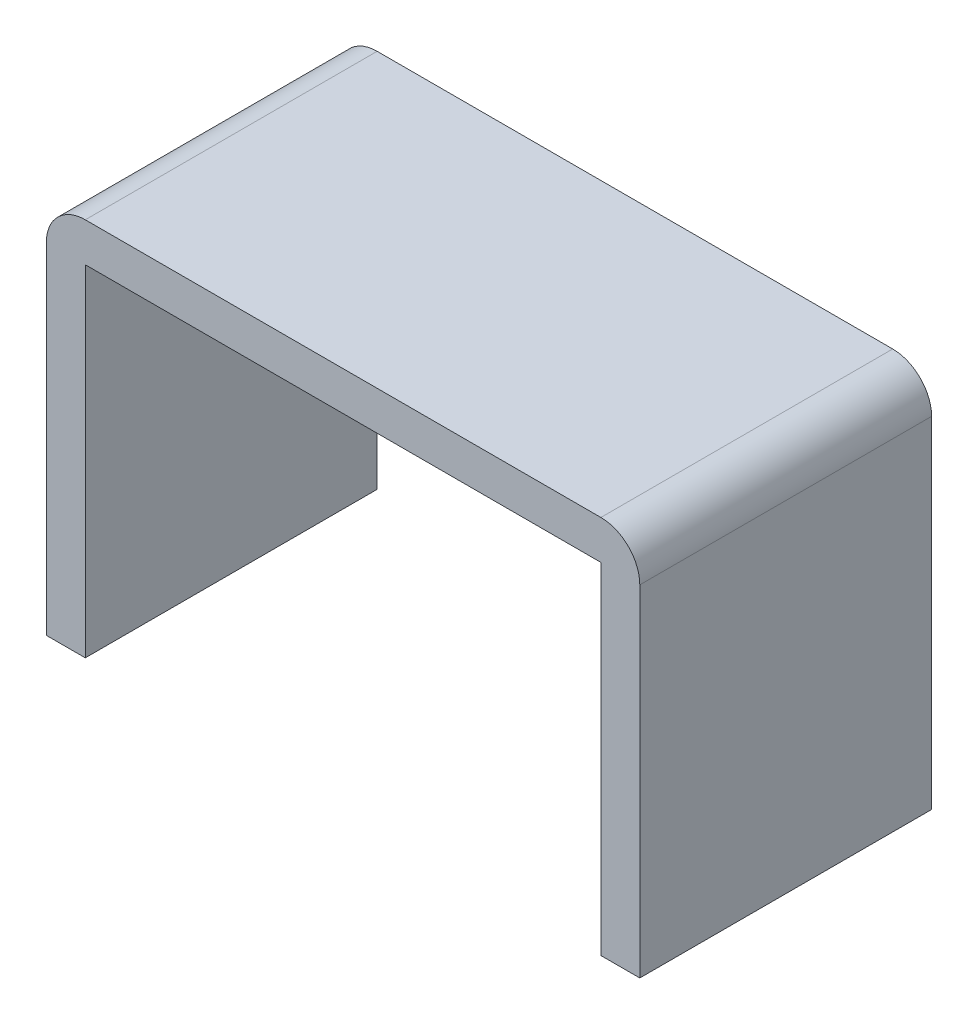
ISO-10303-21;
HEADER;
FILE_DESCRIPTION(('STEP AP214'),'2;1');
FILE_NAME('part.step','',(''),(''),'','','');
FILE_SCHEMA(('AUTOMOTIVE_DESIGN { 1 0 10303 214 1 1 1 1 }'));
ENDSEC;
DATA;
#1=APPLICATION_CONTEXT('core data for automotive mechanical design processes');
#2=APPLICATION_PROTOCOL_DEFINITION('international standard','automotive_design',2000,#1);
#3=PRODUCT_CONTEXT('',#1,'mechanical');
#4=PRODUCT('Part','Part','',(#3));
#5=PRODUCT_RELATED_PRODUCT_CATEGORY('part','',(#4));
#6=PRODUCT_DEFINITION_FORMATION('','',#4);
#7=PRODUCT_DEFINITION_CONTEXT('part definition',#1,'design');
#8=PRODUCT_DEFINITION('design','',#6,#7);
#9=PRODUCT_DEFINITION_SHAPE('','',#8);
#10=(LENGTH_UNIT() NAMED_UNIT(*) SI_UNIT(.MILLI.,.METRE.));
#11=(NAMED_UNIT(*) PLANE_ANGLE_UNIT() SI_UNIT($,.RADIAN.));
#12=(NAMED_UNIT(*) SI_UNIT($,.STERADIAN.) SOLID_ANGLE_UNIT());
#13=UNCERTAINTY_MEASURE_WITH_UNIT(LENGTH_MEASURE(1.E-05),#10,'distance_accuracy_value','');
#14=(GEOMETRIC_REPRESENTATION_CONTEXT(3) GLOBAL_UNCERTAINTY_ASSIGNED_CONTEXT((#13)) GLOBAL_UNIT_ASSIGNED_CONTEXT((#10,
#11,#12)) REPRESENTATION_CONTEXT('',''));
#15=CARTESIAN_POINT('',(0.,0.,0.));
#16=DIRECTION('',(0.,0.,1.));
#17=DIRECTION('',(1.,0.,0.));
#18=AXIS2_PLACEMENT_3D('',#15,#16,#17);
#19=CARTESIAN_POINT('',(4.,0.,30.));
#20=DIRECTION('',(0.,1.,0.));
#21=DIRECTION('',(-1.,0.,0.));
#22=AXIS2_PLACEMENT_3D('',#19,#20,#21);
#23=PLANE('',#22);
#24=DIRECTION('',(1.,0.,0.));
#25=VECTOR('',#24,1.);
#26=CARTESIAN_POINT('',(4.,0.,0.));
#27=LINE('',#26,#25);
#28=CARTESIAN_POINT('',(0.,0.,0.));
#29=VERTEX_POINT('',#28);
#30=CARTESIAN_POINT('',(4.,0.,0.));
#31=VERTEX_POINT('',#30);
#32=EDGE_CURVE('E140',#29,#31,#27,.T.);
#33=ORIENTED_EDGE('',*,*,#32,.T.);
#34=DIRECTION('',(0.,0.,-1.));
#35=VECTOR('',#34,1.);
#36=CARTESIAN_POINT('',(4.,0.,30.));
#37=LINE('',#36,#35);
#38=CARTESIAN_POINT('',(4.,0.,30.));
#39=VERTEX_POINT('',#38);
#40=EDGE_CURVE('E11',#39,#31,#37,.T.);
#41=ORIENTED_EDGE('',*,*,#40,.F.);
#42=DIRECTION('',(1.,0.,0.));
#43=VECTOR('',#42,1.);
#44=CARTESIAN_POINT('',(4.,0.,30.));
#45=LINE('',#44,#43);
#46=CARTESIAN_POINT('',(0.,0.,30.));
#47=VERTEX_POINT('',#46);
#48=EDGE_CURVE('E158',#47,#39,#45,.T.);
#49=ORIENTED_EDGE('',*,*,#48,.F.);
#50=DIRECTION('',(0.,0.,-1.));
#51=VECTOR('',#50,1.);
#52=CARTESIAN_POINT('',(0.,0.,30.));
#53=LINE('',#52,#51);
#54=EDGE_CURVE('E136',#47,#29,#53,.T.);
#55=ORIENTED_EDGE('',*,*,#54,.T.);
#56=EDGE_LOOP('',(#33,#41,#49,#55));
#57=FACE_BOUND('',#56,.T.);
#58=ADVANCED_FACE('F32',(#57),#23,.F.);
#59=CARTESIAN_POINT('',(4.,35.,30.));
#60=DIRECTION('',(-1.,0.,0.));
#61=DIRECTION('',(0.,-1.,0.));
#62=AXIS2_PLACEMENT_3D('',#59,#60,#61);
#63=PLANE('',#62);
#64=DIRECTION('',(0.,1.,0.));
#65=VECTOR('',#64,1.);
#66=CARTESIAN_POINT('',(4.,35.,0.));
#67=LINE('',#66,#65);
#68=CARTESIAN_POINT('',(4.,35.,0.));
#69=VERTEX_POINT('',#68);
#70=EDGE_CURVE('E143',#31,#69,#67,.T.);
#71=ORIENTED_EDGE('',*,*,#70,.T.);
#72=DIRECTION('',(0.,0.,-1.));
#73=VECTOR('',#72,1.);
#74=CARTESIAN_POINT('',(4.,35.,30.));
#75=LINE('',#74,#73);
#76=CARTESIAN_POINT('',(4.,35.,30.));
#77=VERTEX_POINT('',#76);
#78=EDGE_CURVE('E40',#77,#69,#75,.T.);
#79=ORIENTED_EDGE('',*,*,#78,.F.);
#80=DIRECTION('',(0.,1.,0.));
#81=VECTOR('',#80,1.);
#82=CARTESIAN_POINT('',(4.,35.,30.));
#83=LINE('',#82,#81);
#84=EDGE_CURVE('E97',#39,#77,#83,.T.);
#85=ORIENTED_EDGE('',*,*,#84,.F.);
#86=ORIENTED_EDGE('',*,*,#40,.T.);
#87=EDGE_LOOP('',(#71,#79,#85,#86));
#88=FACE_BOUND('',#87,.T.);
#89=ADVANCED_FACE('F207',(#88),#63,.F.);
#90=CARTESIAN_POINT('',(57.,35.,30.));
#91=DIRECTION('',(0.,1.,0.));
#92=DIRECTION('',(-1.,0.,0.));
#93=AXIS2_PLACEMENT_3D('',#90,#91,#92);
#94=PLANE('',#93);
#95=DIRECTION('',(1.,0.,0.));
#96=VECTOR('',#95,1.);
#97=CARTESIAN_POINT('',(57.,35.,0.));
#98=LINE('',#97,#96);
#99=CARTESIAN_POINT('',(57.,35.,0.));
#100=VERTEX_POINT('',#99);
#101=EDGE_CURVE('E145',#69,#100,#98,.T.);
#102=ORIENTED_EDGE('',*,*,#101,.T.);
#103=DIRECTION('',(0.,0.,-1.));
#104=VECTOR('',#103,1.);
#105=CARTESIAN_POINT('',(57.,35.,30.));
#106=LINE('',#105,#104);
#107=CARTESIAN_POINT('',(57.,35.,30.));
#108=VERTEX_POINT('',#107);
#109=EDGE_CURVE('E171',#108,#100,#106,.T.);
#110=ORIENTED_EDGE('',*,*,#109,.F.);
#111=DIRECTION('',(1.,0.,0.));
#112=VECTOR('',#111,1.);
#113=CARTESIAN_POINT('',(57.,35.,30.));
#114=LINE('',#113,#112);
#115=EDGE_CURVE('E179',#77,#108,#114,.T.);
#116=ORIENTED_EDGE('',*,*,#115,.F.);
#117=ORIENTED_EDGE('',*,*,#78,.T.);
#118=EDGE_LOOP('',(#102,#110,#116,#117));
#119=FACE_BOUND('',#118,.T.);
#120=ADVANCED_FACE('F177',(#119),#94,.F.);
#121=CARTESIAN_POINT('',(57.,0.,30.));
#122=DIRECTION('',(1.,0.,0.));
#123=DIRECTION('',(0.,1.,0.));
#124=AXIS2_PLACEMENT_3D('',#121,#122,#123);
#125=PLANE('',#124);
#126=DIRECTION('',(0.,-1.,0.));
#127=VECTOR('',#126,1.);
#128=CARTESIAN_POINT('',(57.,0.,0.));
#129=LINE('',#128,#127);
#130=CARTESIAN_POINT('',(57.,0.,0.));
#131=VERTEX_POINT('',#130);
#132=EDGE_CURVE('E147',#100,#131,#129,.T.);
#133=ORIENTED_EDGE('',*,*,#132,.T.);
#134=DIRECTION('',(0.,0.,-1.));
#135=VECTOR('',#134,1.);
#136=CARTESIAN_POINT('',(57.,0.,30.));
#137=LINE('',#136,#135);
#138=CARTESIAN_POINT('',(57.,0.,30.));
#139=VERTEX_POINT('',#138);
#140=EDGE_CURVE('E168',#139,#131,#137,.T.);
#141=ORIENTED_EDGE('',*,*,#140,.F.);
#142=DIRECTION('',(0.,-1.,0.));
#143=VECTOR('',#142,1.);
#144=CARTESIAN_POINT('',(57.,0.,30.));
#145=LINE('',#144,#143);
#146=EDGE_CURVE('E197',#108,#139,#145,.T.);
#147=ORIENTED_EDGE('',*,*,#146,.F.);
#148=ORIENTED_EDGE('',*,*,#109,.T.);
#149=EDGE_LOOP('',(#133,#141,#147,#148));
#150=FACE_BOUND('',#149,.T.);
#151=ADVANCED_FACE('F188',(#150),#125,.F.);
#152=CARTESIAN_POINT('',(61.,0.,30.));
#153=DIRECTION('',(0.,1.,0.));
#154=DIRECTION('',(-1.,0.,0.));
#155=AXIS2_PLACEMENT_3D('',#152,#153,#154);
#156=PLANE('',#155);
#157=DIRECTION('',(1.,0.,0.));
#158=VECTOR('',#157,1.);
#159=CARTESIAN_POINT('',(61.,0.,0.));
#160=LINE('',#159,#158);
#161=CARTESIAN_POINT('',(61.,0.,0.));
#162=VERTEX_POINT('',#161);
#163=EDGE_CURVE('E149',#131,#162,#160,.T.);
#164=ORIENTED_EDGE('',*,*,#163,.T.);
#165=DIRECTION('',(0.,0.,-1.));
#166=VECTOR('',#165,1.);
#167=CARTESIAN_POINT('',(61.,0.,30.));
#168=LINE('',#167,#166);
#169=CARTESIAN_POINT('',(61.,0.,30.));
#170=VERTEX_POINT('',#169);
#171=EDGE_CURVE('E165',#170,#162,#168,.T.);
#172=ORIENTED_EDGE('',*,*,#171,.F.);
#173=DIRECTION('',(1.,0.,0.));
#174=VECTOR('',#173,1.);
#175=CARTESIAN_POINT('',(61.,0.,30.));
#176=LINE('',#175,#174);
#177=EDGE_CURVE('E194',#139,#170,#176,.T.);
#178=ORIENTED_EDGE('',*,*,#177,.F.);
#179=ORIENTED_EDGE('',*,*,#140,.T.);
#180=EDGE_LOOP('',(#164,#172,#178,#179));
#181=FACE_BOUND('',#180,.T.);
#182=ADVANCED_FACE('F192',(#181),#156,.F.);
#183=CARTESIAN_POINT('',(61.,35.,30.));
#184=DIRECTION('',(-1.,0.,0.));
#185=DIRECTION('',(0.,-1.,0.));
#186=AXIS2_PLACEMENT_3D('',#183,#184,#185);
#187=PLANE('',#186);
#188=DIRECTION('',(0.,1.,0.));
#189=VECTOR('',#188,1.);
#190=CARTESIAN_POINT('',(61.,35.,0.));
#191=LINE('',#190,#189);
#192=CARTESIAN_POINT('',(61.,35.,0.));
#193=VERTEX_POINT('',#192);
#194=EDGE_CURVE('E151',#162,#193,#191,.T.);
#195=ORIENTED_EDGE('',*,*,#194,.T.);
#196=DIRECTION('',(0.,0.,-1.));
#197=VECTOR('',#196,1.);
#198=CARTESIAN_POINT('',(61.,35.,30.));
#199=LINE('',#198,#197);
#200=CARTESIAN_POINT('',(61.,35.,30.));
#201=VERTEX_POINT('',#200);
#202=EDGE_CURVE('E162',#201,#193,#199,.T.);
#203=ORIENTED_EDGE('',*,*,#202,.F.);
#204=DIRECTION('',(0.,1.,0.));
#205=VECTOR('',#204,1.);
#206=CARTESIAN_POINT('',(61.,35.,30.));
#207=LINE('',#206,#205);
#208=EDGE_CURVE('E196',#170,#201,#207,.T.);
#209=ORIENTED_EDGE('',*,*,#208,.F.);
#210=ORIENTED_EDGE('',*,*,#171,.T.);
#211=EDGE_LOOP('',(#195,#203,#209,#210));
#212=FACE_BOUND('',#211,.T.);
#213=ADVANCED_FACE('F219',(#212),#187,.F.);
#214=CARTESIAN_POINT('',(57.,35.,30.));
#215=DIRECTION('',(0.,0.,-1.));
#216=DIRECTION('',(-1.,0.,0.));
#217=AXIS2_PLACEMENT_3D('',#214,#215,#216);
#218=CYLINDRICAL_SURFACE('',#217,4.);
#219=CARTESIAN_POINT('',(57.,35.,0.));
#220=DIRECTION('',(0.,0.,1.));
#221=DIRECTION('',(-1.,0.,0.));
#222=AXIS2_PLACEMENT_3D('',#219,#220,#221);
#223=CIRCLE('',#222,4.);
#224=CARTESIAN_POINT('',(57.,39.,0.));
#225=VERTEX_POINT('',#224);
#226=EDGE_CURVE('E153',#193,#225,#223,.T.);
#227=ORIENTED_EDGE('',*,*,#226,.T.);
#228=DIRECTION('',(0.,0.,-1.));
#229=VECTOR('',#228,1.);
#230=CARTESIAN_POINT('',(57.,39.,30.));
#231=LINE('',#230,#229);
#232=CARTESIAN_POINT('',(57.,39.,30.));
#233=VERTEX_POINT('',#232);
#234=EDGE_CURVE('E131',#233,#225,#231,.T.);
#235=ORIENTED_EDGE('',*,*,#234,.F.);
#236=CARTESIAN_POINT('',(57.,35.,30.));
#237=DIRECTION('',(0.,0.,1.));
#238=DIRECTION('',(-1.,0.,0.));
#239=AXIS2_PLACEMENT_3D('',#236,#237,#238);
#240=CIRCLE('',#239,4.);
#241=EDGE_CURVE('E122',#201,#233,#240,.T.);
#242=ORIENTED_EDGE('',*,*,#241,.F.);
#243=ORIENTED_EDGE('',*,*,#202,.T.);
#244=EDGE_LOOP('',(#227,#235,#242,#243));
#245=FACE_BOUND('',#244,.T.);
#246=ADVANCED_FACE('F222',(#245),#218,.T.);
#247=CARTESIAN_POINT('',(4.00000000000003,39.,30.));
#248=DIRECTION('',(0.,-1.,0.));
#249=DIRECTION('',(0.,0.,-1.));
#250=AXIS2_PLACEMENT_3D('',#247,#248,#249);
#251=PLANE('',#250);
#252=DIRECTION('',(-1.,0.,0.));
#253=VECTOR('',#252,1.);
#254=CARTESIAN_POINT('',(4.00000000000003,39.,0.));
#255=LINE('',#254,#253);
#256=CARTESIAN_POINT('',(4.00000000000003,39.,0.));
#257=VERTEX_POINT('',#256);
#258=EDGE_CURVE('E130',#225,#257,#255,.T.);
#259=ORIENTED_EDGE('',*,*,#258,.T.);
#260=DIRECTION('',(0.,0.,-1.));
#261=VECTOR('',#260,1.);
#262=CARTESIAN_POINT('',(4.00000000000003,39.,30.));
#263=LINE('',#262,#261);
#264=CARTESIAN_POINT('',(4.00000000000003,39.,30.));
#265=VERTEX_POINT('',#264);
#266=EDGE_CURVE('E127',#265,#257,#263,.T.);
#267=ORIENTED_EDGE('',*,*,#266,.F.);
#268=DIRECTION('',(-1.,0.,0.));
#269=VECTOR('',#268,1.);
#270=CARTESIAN_POINT('',(4.00000000000003,39.,30.));
#271=LINE('',#270,#269);
#272=EDGE_CURVE('E116',#233,#265,#271,.T.);
#273=ORIENTED_EDGE('',*,*,#272,.F.);
#274=ORIENTED_EDGE('',*,*,#234,.T.);
#275=EDGE_LOOP('',(#259,#267,#273,#274));
#276=FACE_BOUND('',#275,.T.);
#277=ADVANCED_FACE('F128',(#276),#251,.F.);
#278=CARTESIAN_POINT('',(4.,35.,30.));
#279=DIRECTION('',(0.,0.,-1.));
#280=DIRECTION('',(-1.,0.,0.));
#281=AXIS2_PLACEMENT_3D('',#278,#279,#280);
#282=CYLINDRICAL_SURFACE('',#281,4.);
#283=CARTESIAN_POINT('',(4.,35.,0.));
#284=DIRECTION('',(0.,0.,1.));
#285=DIRECTION('',(-1.,0.,0.));
#286=AXIS2_PLACEMENT_3D('',#283,#284,#285);
#287=CIRCLE('',#286,4.);
#288=CARTESIAN_POINT('',(0.,35.,0.));
#289=VERTEX_POINT('',#288);
#290=EDGE_CURVE('E83',#257,#289,#287,.T.);
#291=ORIENTED_EDGE('',*,*,#290,.T.);
#292=DIRECTION('',(0.,0.,-1.));
#293=VECTOR('',#292,1.);
#294=CARTESIAN_POINT('',(0.,35.,30.));
#295=LINE('',#294,#293);
#296=CARTESIAN_POINT('',(0.,35.,30.));
#297=VERTEX_POINT('',#296);
#298=EDGE_CURVE('E132',#297,#289,#295,.T.);
#299=ORIENTED_EDGE('',*,*,#298,.F.);
#300=CARTESIAN_POINT('',(4.,35.,30.));
#301=DIRECTION('',(0.,0.,1.));
#302=DIRECTION('',(-1.,0.,0.));
#303=AXIS2_PLACEMENT_3D('',#300,#301,#302);
#304=CIRCLE('',#303,4.);
#305=EDGE_CURVE('E120',#265,#297,#304,.T.);
#306=ORIENTED_EDGE('',*,*,#305,.F.);
#307=ORIENTED_EDGE('',*,*,#266,.T.);
#308=EDGE_LOOP('',(#291,#299,#306,#307));
#309=FACE_BOUND('',#308,.T.);
#310=ADVANCED_FACE('F134',(#309),#282,.T.);
#311=CARTESIAN_POINT('',(0.,0.,30.));
#312=DIRECTION('',(1.,0.,0.));
#313=DIRECTION('',(0.,0.,-1.));
#314=AXIS2_PLACEMENT_3D('',#311,#312,#313);
#315=PLANE('',#314);
#316=DIRECTION('',(0.,-1.,0.));
#317=VECTOR('',#316,1.);
#318=CARTESIAN_POINT('',(0.,0.,0.));
#319=LINE('',#318,#317);
#320=EDGE_CURVE('E89',#289,#29,#319,.T.);
#321=ORIENTED_EDGE('',*,*,#320,.T.);
#322=ORIENTED_EDGE('',*,*,#54,.F.);
#323=DIRECTION('',(0.,-1.,0.));
#324=VECTOR('',#323,1.);
#325=CARTESIAN_POINT('',(0.,0.,30.));
#326=LINE('',#325,#324);
#327=EDGE_CURVE('E48',#297,#47,#326,.T.);
#328=ORIENTED_EDGE('',*,*,#327,.F.);
#329=ORIENTED_EDGE('',*,*,#298,.T.);
#330=EDGE_LOOP('',(#321,#322,#328,#329));
#331=FACE_BOUND('',#330,.T.);
#332=ADVANCED_FACE('F231',(#331),#315,.F.);
#333=CARTESIAN_POINT('',(4.,35.,30.));
#334=DIRECTION('',(0.,0.,-1.));
#335=DIRECTION('',(-1.,0.,0.));
#336=AXIS2_PLACEMENT_3D('',#333,#334,#335);
#337=PLANE('',#336);
#338=ORIENTED_EDGE('',*,*,#48,.T.);
#339=ORIENTED_EDGE('',*,*,#84,.T.);
#340=ORIENTED_EDGE('',*,*,#115,.T.);
#341=ORIENTED_EDGE('',*,*,#146,.T.);
#342=ORIENTED_EDGE('',*,*,#177,.T.);
#343=ORIENTED_EDGE('',*,*,#208,.T.);
#344=ORIENTED_EDGE('',*,*,#241,.T.);
#345=ORIENTED_EDGE('',*,*,#272,.T.);
#346=ORIENTED_EDGE('',*,*,#305,.T.);
#347=ORIENTED_EDGE('',*,*,#327,.T.);
#348=EDGE_LOOP('',(#338,#339,#340,#341,#342,#343,#344,#345,#346,#347));
#349=FACE_BOUND('',#348,.T.);
#350=ADVANCED_FACE('F118',(#349),#337,.F.);
#351=CARTESIAN_POINT('',(4.,35.,0.));
#352=DIRECTION('',(0.,0.,-1.));
#353=DIRECTION('',(-1.,0.,0.));
#354=AXIS2_PLACEMENT_3D('',#351,#352,#353);
#355=PLANE('',#354);
#356=ORIENTED_EDGE('',*,*,#32,.F.);
#357=ORIENTED_EDGE('',*,*,#320,.F.);
#358=ORIENTED_EDGE('',*,*,#290,.F.);
#359=ORIENTED_EDGE('',*,*,#258,.F.);
#360=ORIENTED_EDGE('',*,*,#226,.F.);
#361=ORIENTED_EDGE('',*,*,#194,.F.);
#362=ORIENTED_EDGE('',*,*,#163,.F.);
#363=ORIENTED_EDGE('',*,*,#132,.F.);
#364=ORIENTED_EDGE('',*,*,#101,.F.);
#365=ORIENTED_EDGE('',*,*,#70,.F.);
#366=EDGE_LOOP('',(#356,#357,#358,#359,#360,#361,#362,#363,#364,#365));
#367=FACE_BOUND('',#366,.T.);
#368=ADVANCED_FACE('F183',(#367),#355,.T.);
#369=CLOSED_SHELL('',(#58,#89,#120,#151,#182,#213,#246,#277,#310,#332,#350,#368));
#370=MANIFOLD_SOLID_BREP('B2',#369);
#371=ADVANCED_BREP_SHAPE_REPRESENTATION('',(#18,#370),#14);
#372=SHAPE_DEFINITION_REPRESENTATION(#9,#371);
ENDSEC;
END-ISO-10303-21;
